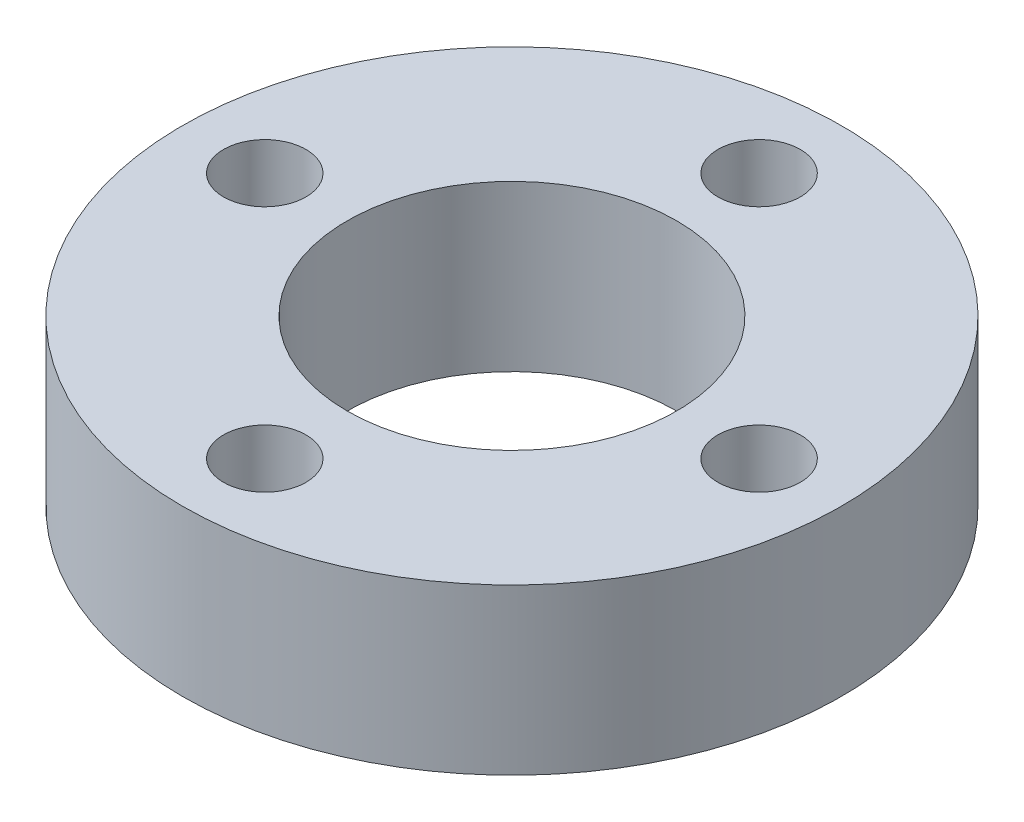
ISO-10303-21;
HEADER;
FILE_DESCRIPTION(('STEP AP214'),'2;1');
FILE_NAME('part.step','',(''),(''),'','','');
FILE_SCHEMA(('AUTOMOTIVE_DESIGN { 1 0 10303 214 1 1 1 1 }'));
ENDSEC;
DATA;
#1=APPLICATION_CONTEXT('core data for automotive mechanical design processes');
#2=APPLICATION_PROTOCOL_DEFINITION('international standard','automotive_design',2000,#1);
#3=PRODUCT_CONTEXT('',#1,'mechanical');
#4=PRODUCT('Part','Part','',(#3));
#5=PRODUCT_RELATED_PRODUCT_CATEGORY('part','',(#4));
#6=PRODUCT_DEFINITION_FORMATION('','',#4);
#7=PRODUCT_DEFINITION_CONTEXT('part definition',#1,'design');
#8=PRODUCT_DEFINITION('design','',#6,#7);
#9=PRODUCT_DEFINITION_SHAPE('','',#8);
#10=(LENGTH_UNIT() NAMED_UNIT(*) SI_UNIT(.MILLI.,.METRE.));
#11=(NAMED_UNIT(*) PLANE_ANGLE_UNIT() SI_UNIT($,.RADIAN.));
#12=(NAMED_UNIT(*) SI_UNIT($,.STERADIAN.) SOLID_ANGLE_UNIT());
#13=UNCERTAINTY_MEASURE_WITH_UNIT(LENGTH_MEASURE(1.E-05),#10,'distance_accuracy_value','');
#14=(GEOMETRIC_REPRESENTATION_CONTEXT(3) GLOBAL_UNCERTAINTY_ASSIGNED_CONTEXT((#13)) GLOBAL_UNIT_ASSIGNED_CONTEXT((#10,
#11,#12)) REPRESENTATION_CONTEXT('',''));
#15=CARTESIAN_POINT('',(0.,0.,0.));
#16=DIRECTION('',(0.,0.,1.));
#17=DIRECTION('',(1.,0.,0.));
#18=AXIS2_PLACEMENT_3D('',#15,#16,#17);
#19=CARTESIAN_POINT('',(0.,5.,0.));
#20=DIRECTION('',(0.,-1.,0.));
#21=DIRECTION('',(0.,0.,-1.));
#22=AXIS2_PLACEMENT_3D('',#19,#20,#21);
#23=CYLINDRICAL_SURFACE('',#22,10.);
#24=CARTESIAN_POINT('',(0.,5.,0.));
#25=DIRECTION('',(0.,1.,0.));
#26=DIRECTION('',(0.,0.,1.));
#27=AXIS2_PLACEMENT_3D('',#24,#25,#26);
#28=CIRCLE('',#27,10.);
#29=CARTESIAN_POINT('',(0.,5.,10.));
#30=VERTEX_POINT('',#29);
#31=EDGE_CURVE('E10',#30,#30,#28,.T.);
#32=ORIENTED_EDGE('',*,*,#31,.F.);
#33=EDGE_LOOP('',(#32));
#34=FACE_BOUND('',#33,.T.);
#35=CARTESIAN_POINT('',(0.,0.,0.));
#36=DIRECTION('',(0.,1.,0.));
#37=DIRECTION('',(0.,0.,1.));
#38=AXIS2_PLACEMENT_3D('',#35,#36,#37);
#39=CIRCLE('',#38,10.);
#40=CARTESIAN_POINT('',(0.,0.,10.));
#41=VERTEX_POINT('',#40);
#42=EDGE_CURVE('E37',#41,#41,#39,.T.);
#43=ORIENTED_EDGE('',*,*,#42,.T.);
#44=EDGE_LOOP('',(#43));
#45=FACE_BOUND('',#44,.T.);
#46=ADVANCED_FACE('F40',(#34,#45),#23,.T.);
#47=CARTESIAN_POINT('',(0.,5.,0.));
#48=DIRECTION('',(0.,1.,0.));
#49=DIRECTION('',(0.,0.,1.));
#50=AXIS2_PLACEMENT_3D('',#47,#48,#49);
#51=PLANE('',#50);
#52=CARTESIAN_POINT('',(0.,5.,7.5));
#53=DIRECTION('',(0.,1.,0.));
#54=DIRECTION('',(1.,0.,0.));
#55=AXIS2_PLACEMENT_3D('',#52,#53,#54);
#56=CIRCLE('',#55,1.25);
#57=CARTESIAN_POINT('',(1.25000000000003,5.,7.5));
#58=VERTEX_POINT('',#57);
#59=EDGE_CURVE('E71',#58,#58,#56,.T.);
#60=ORIENTED_EDGE('',*,*,#59,.F.);
#61=EDGE_LOOP('',(#60));
#62=FACE_BOUND('',#61,.T.);
#63=CARTESIAN_POINT('',(7.5,5.,0.));
#64=DIRECTION('',(0.,1.,0.));
#65=DIRECTION('',(0.,0.,-1.));
#66=AXIS2_PLACEMENT_3D('',#63,#64,#65);
#67=CIRCLE('',#66,1.25);
#68=CARTESIAN_POINT('',(7.5,5.,-1.25));
#69=VERTEX_POINT('',#68);
#70=EDGE_CURVE('E70',#69,#69,#67,.T.);
#71=ORIENTED_EDGE('',*,*,#70,.F.);
#72=EDGE_LOOP('',(#71));
#73=FACE_BOUND('',#72,.T.);
#74=CARTESIAN_POINT('',(0.,5.,-7.5));
#75=DIRECTION('',(0.,1.,0.));
#76=DIRECTION('',(-1.,0.,0.));
#77=AXIS2_PLACEMENT_3D('',#74,#75,#76);
#78=CIRCLE('',#77,1.25);
#79=CARTESIAN_POINT('',(-1.25000000000008,5.,-7.49999999999999));
#80=VERTEX_POINT('',#79);
#81=EDGE_CURVE('E62',#80,#80,#78,.T.);
#82=ORIENTED_EDGE('',*,*,#81,.F.);
#83=EDGE_LOOP('',(#82));
#84=FACE_BOUND('',#83,.T.);
#85=CARTESIAN_POINT('',(-7.5,5.,0.));
#86=DIRECTION('',(0.,1.,0.));
#87=DIRECTION('',(0.,0.,1.));
#88=AXIS2_PLACEMENT_3D('',#85,#86,#87);
#89=CIRCLE('',#88,1.25);
#90=CARTESIAN_POINT('',(-7.5,5.,1.25));
#91=VERTEX_POINT('',#90);
#92=EDGE_CURVE('E54',#91,#91,#89,.T.);
#93=ORIENTED_EDGE('',*,*,#92,.F.);
#94=EDGE_LOOP('',(#93));
#95=FACE_BOUND('',#94,.T.);
#96=CARTESIAN_POINT('',(0.,5.,0.));
#97=DIRECTION('',(0.,1.,0.));
#98=DIRECTION('',(0.,0.,1.));
#99=AXIS2_PLACEMENT_3D('',#96,#97,#98);
#100=CIRCLE('',#99,5.);
#101=CARTESIAN_POINT('',(0.,5.,5.));
#102=VERTEX_POINT('',#101);
#103=EDGE_CURVE('E50',#102,#102,#100,.T.);
#104=ORIENTED_EDGE('',*,*,#103,.F.);
#105=EDGE_LOOP('',(#104));
#106=FACE_BOUND('',#105,.T.);
#107=ORIENTED_EDGE('',*,*,#31,.T.);
#108=EDGE_LOOP('',(#107));
#109=FACE_BOUND('',#108,.T.);
#110=ADVANCED_FACE('F90',(#62,#73,#84,#95,#106,#109),#51,.T.);
#111=CARTESIAN_POINT('',(0.,0.,0.));
#112=DIRECTION('',(0.,1.,0.));
#113=DIRECTION('',(0.,0.,1.));
#114=AXIS2_PLACEMENT_3D('',#111,#112,#113);
#115=PLANE('',#114);
#116=CARTESIAN_POINT('',(0.,0.,7.5));
#117=DIRECTION('',(0.,1.,0.));
#118=DIRECTION('',(1.,0.,0.));
#119=AXIS2_PLACEMENT_3D('',#116,#117,#118);
#120=CIRCLE('',#119,1.25);
#121=CARTESIAN_POINT('',(1.25000000000003,0.,7.5));
#122=VERTEX_POINT('',#121);
#123=EDGE_CURVE('E59',#122,#122,#120,.T.);
#124=ORIENTED_EDGE('',*,*,#123,.T.);
#125=EDGE_LOOP('',(#124));
#126=FACE_BOUND('',#125,.T.);
#127=CARTESIAN_POINT('',(7.5,0.,0.));
#128=DIRECTION('',(0.,1.,0.));
#129=DIRECTION('',(0.,0.,-1.));
#130=AXIS2_PLACEMENT_3D('',#127,#128,#129);
#131=CIRCLE('',#130,1.25);
#132=CARTESIAN_POINT('',(7.5,0.,-1.25));
#133=VERTEX_POINT('',#132);
#134=EDGE_CURVE('E69',#133,#133,#131,.T.);
#135=ORIENTED_EDGE('',*,*,#134,.T.);
#136=EDGE_LOOP('',(#135));
#137=FACE_BOUND('',#136,.T.);
#138=CARTESIAN_POINT('',(0.,0.,-7.5));
#139=DIRECTION('',(0.,1.,0.));
#140=DIRECTION('',(-1.,0.,0.));
#141=AXIS2_PLACEMENT_3D('',#138,#139,#140);
#142=CIRCLE('',#141,1.25);
#143=CARTESIAN_POINT('',(-1.25000000000008,0.,-7.49999999999999));
#144=VERTEX_POINT('',#143);
#145=EDGE_CURVE('E61',#144,#144,#142,.T.);
#146=ORIENTED_EDGE('',*,*,#145,.T.);
#147=EDGE_LOOP('',(#146));
#148=FACE_BOUND('',#147,.T.);
#149=CARTESIAN_POINT('',(-7.5,0.,0.));
#150=DIRECTION('',(0.,1.,0.));
#151=DIRECTION('',(0.,0.,1.));
#152=AXIS2_PLACEMENT_3D('',#149,#150,#151);
#153=CIRCLE('',#152,1.25);
#154=CARTESIAN_POINT('',(-7.5,0.,1.25));
#155=VERTEX_POINT('',#154);
#156=EDGE_CURVE('E55',#155,#155,#153,.T.);
#157=ORIENTED_EDGE('',*,*,#156,.T.);
#158=EDGE_LOOP('',(#157));
#159=FACE_BOUND('',#158,.T.);
#160=CARTESIAN_POINT('',(0.,0.,0.));
#161=DIRECTION('',(0.,1.,0.));
#162=DIRECTION('',(0.,0.,1.));
#163=AXIS2_PLACEMENT_3D('',#160,#161,#162);
#164=CIRCLE('',#163,5.);
#165=CARTESIAN_POINT('',(0.,0.,5.));
#166=VERTEX_POINT('',#165);
#167=EDGE_CURVE('E47',#166,#166,#164,.T.);
#168=ORIENTED_EDGE('',*,*,#167,.T.);
#169=EDGE_LOOP('',(#168));
#170=FACE_BOUND('',#169,.T.);
#171=ORIENTED_EDGE('',*,*,#42,.F.);
#172=EDGE_LOOP('',(#171));
#173=FACE_BOUND('',#172,.T.);
#174=ADVANCED_FACE('F76',(#126,#137,#148,#159,#170,#173),#115,.F.);
#175=CARTESIAN_POINT('',(0.,5.,0.));
#176=DIRECTION('',(0.,-1.,0.));
#177=DIRECTION('',(0.,0.,-1.));
#178=AXIS2_PLACEMENT_3D('',#175,#176,#177);
#179=CYLINDRICAL_SURFACE('',#178,5.);
#180=ORIENTED_EDGE('',*,*,#103,.T.);
#181=EDGE_LOOP('',(#180));
#182=FACE_BOUND('',#181,.T.);
#183=ORIENTED_EDGE('',*,*,#167,.F.);
#184=EDGE_LOOP('',(#183));
#185=FACE_BOUND('',#184,.T.);
#186=ADVANCED_FACE('F101',(#182,#185),#179,.F.);
#187=CARTESIAN_POINT('',(-7.5,0.,0.));
#188=DIRECTION('',(0.,1.,0.));
#189=DIRECTION('',(0.,0.,1.));
#190=AXIS2_PLACEMENT_3D('',#187,#188,#189);
#191=CYLINDRICAL_SURFACE('',#190,1.25);
#192=ORIENTED_EDGE('',*,*,#156,.F.);
#193=EDGE_LOOP('',(#192));
#194=FACE_BOUND('',#193,.T.);
#195=ORIENTED_EDGE('',*,*,#92,.T.);
#196=EDGE_LOOP('',(#195));
#197=FACE_BOUND('',#196,.T.);
#198=ADVANCED_FACE('F102',(#194,#197),#191,.F.);
#199=CARTESIAN_POINT('',(0.,0.,-7.5));
#200=DIRECTION('',(0.,1.,0.));
#201=DIRECTION('',(0.,0.,1.));
#202=AXIS2_PLACEMENT_3D('',#199,#200,#201);
#203=CYLINDRICAL_SURFACE('',#202,1.25);
#204=ORIENTED_EDGE('',*,*,#145,.F.);
#205=EDGE_LOOP('',(#204));
#206=FACE_BOUND('',#205,.T.);
#207=ORIENTED_EDGE('',*,*,#81,.T.);
#208=EDGE_LOOP('',(#207));
#209=FACE_BOUND('',#208,.T.);
#210=ADVANCED_FACE('F129',(#206,#209),#203,.F.);
#211=CARTESIAN_POINT('',(7.5,0.,0.));
#212=DIRECTION('',(0.,1.,0.));
#213=DIRECTION('',(0.,0.,1.));
#214=AXIS2_PLACEMENT_3D('',#211,#212,#213);
#215=CYLINDRICAL_SURFACE('',#214,1.25);
#216=ORIENTED_EDGE('',*,*,#134,.F.);
#217=EDGE_LOOP('',(#216));
#218=FACE_BOUND('',#217,.T.);
#219=ORIENTED_EDGE('',*,*,#70,.T.);
#220=EDGE_LOOP('',(#219));
#221=FACE_BOUND('',#220,.T.);
#222=ADVANCED_FACE('F84',(#218,#221),#215,.F.);
#223=CARTESIAN_POINT('',(0.,0.,7.5));
#224=DIRECTION('',(0.,1.,0.));
#225=DIRECTION('',(0.,0.,1.));
#226=AXIS2_PLACEMENT_3D('',#223,#224,#225);
#227=CYLINDRICAL_SURFACE('',#226,1.25);
#228=ORIENTED_EDGE('',*,*,#123,.F.);
#229=EDGE_LOOP('',(#228));
#230=FACE_BOUND('',#229,.T.);
#231=ORIENTED_EDGE('',*,*,#59,.T.);
#232=EDGE_LOOP('',(#231));
#233=FACE_BOUND('',#232,.T.);
#234=ADVANCED_FACE('F85',(#230,#233),#227,.F.);
#235=CLOSED_SHELL('',(#46,#110,#174,#186,#198,#210,#222,#234));
#236=MANIFOLD_SOLID_BREP('B2',#235);
#237=ADVANCED_BREP_SHAPE_REPRESENTATION('',(#18,#236),#14);
#238=SHAPE_DEFINITION_REPRESENTATION(#9,#237);
ENDSEC;
END-ISO-10303-21;
